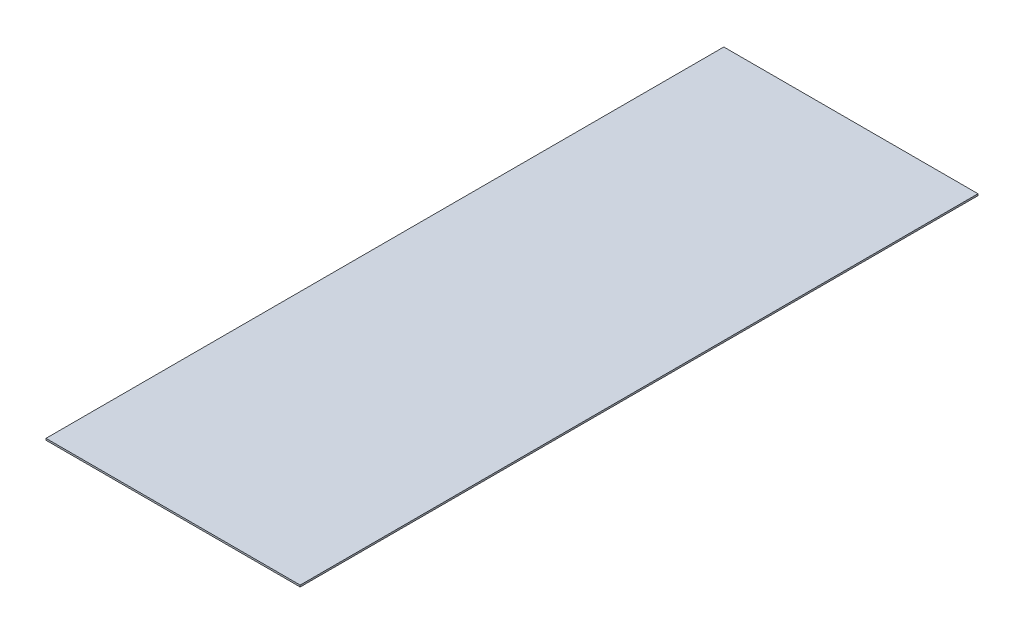
ISO-10303-21;
HEADER;
FILE_DESCRIPTION(('STEP AP214'),'2;1');
FILE_NAME('part.step','',(''),(''),'','','');
FILE_SCHEMA(('AUTOMOTIVE_DESIGN { 1 0 10303 214 1 1 1 1 }'));
ENDSEC;
DATA;
#1=APPLICATION_CONTEXT('core data for automotive mechanical design processes');
#2=APPLICATION_PROTOCOL_DEFINITION('international standard','automotive_design',2000,#1);
#3=PRODUCT_CONTEXT('',#1,'mechanical');
#4=PRODUCT('Part','Part','',(#3));
#5=PRODUCT_RELATED_PRODUCT_CATEGORY('part','',(#4));
#6=PRODUCT_DEFINITION_FORMATION('','',#4);
#7=PRODUCT_DEFINITION_CONTEXT('part definition',#1,'design');
#8=PRODUCT_DEFINITION('design','',#6,#7);
#9=PRODUCT_DEFINITION_SHAPE('','',#8);
#10=(LENGTH_UNIT() NAMED_UNIT(*) SI_UNIT(.MILLI.,.METRE.));
#11=(NAMED_UNIT(*) PLANE_ANGLE_UNIT() SI_UNIT($,.RADIAN.));
#12=(NAMED_UNIT(*) SI_UNIT($,.STERADIAN.) SOLID_ANGLE_UNIT());
#13=UNCERTAINTY_MEASURE_WITH_UNIT(LENGTH_MEASURE(1.E-05),#10,'distance_accuracy_value','');
#14=(GEOMETRIC_REPRESENTATION_CONTEXT(3) GLOBAL_UNCERTAINTY_ASSIGNED_CONTEXT((#13)) GLOBAL_UNIT_ASSIGNED_CONTEXT((#10,
#11,#12)) REPRESENTATION_CONTEXT('',''));
#15=CARTESIAN_POINT('',(0.,0.,0.));
#16=DIRECTION('',(0.,0.,1.));
#17=DIRECTION('',(1.,0.,0.));
#18=AXIS2_PLACEMENT_3D('',#15,#16,#17);
#19=CARTESIAN_POINT('',(0.75,0.01,-2.));
#20=DIRECTION('',(-1.,0.,0.));
#21=DIRECTION('',(0.,0.,1.));
#22=AXIS2_PLACEMENT_3D('',#19,#20,#21);
#23=PLANE('',#22);
#24=DIRECTION('',(0.,0.,-1.));
#25=VECTOR('',#24,1.);
#26=CARTESIAN_POINT('',(0.75,0.,-2.));
#27=LINE('',#26,#25);
#28=CARTESIAN_POINT('',(0.75,0.,2.));
#29=VERTEX_POINT('',#28);
#30=CARTESIAN_POINT('',(0.75,0.,-2.));
#31=VERTEX_POINT('',#30);
#32=EDGE_CURVE('E96',#29,#31,#27,.T.);
#33=ORIENTED_EDGE('',*,*,#32,.T.);
#34=DIRECTION('',(0.,-1.,0.));
#35=VECTOR('',#34,1.);
#36=CARTESIAN_POINT('',(0.75,0.01,-2.));
#37=LINE('',#36,#35);
#38=CARTESIAN_POINT('',(0.75,0.01,-2.));
#39=VERTEX_POINT('',#38);
#40=EDGE_CURVE('E11',#39,#31,#37,.T.);
#41=ORIENTED_EDGE('',*,*,#40,.F.);
#42=DIRECTION('',(0.,0.,-1.));
#43=VECTOR('',#42,1.);
#44=CARTESIAN_POINT('',(0.75,0.01,-2.));
#45=LINE('',#44,#43);
#46=CARTESIAN_POINT('',(0.75,0.01,2.));
#47=VERTEX_POINT('',#46);
#48=EDGE_CURVE('E84',#47,#39,#45,.T.);
#49=ORIENTED_EDGE('',*,*,#48,.F.);
#50=DIRECTION('',(0.,-1.,0.));
#51=VECTOR('',#50,1.);
#52=CARTESIAN_POINT('',(0.75,0.01,2.));
#53=LINE('',#52,#51);
#54=EDGE_CURVE('E92',#47,#29,#53,.T.);
#55=ORIENTED_EDGE('',*,*,#54,.T.);
#56=EDGE_LOOP('',(#33,#41,#49,#55));
#57=FACE_BOUND('',#56,.T.);
#58=ADVANCED_FACE('F33',(#57),#23,.F.);
#59=CARTESIAN_POINT('',(-0.75,0.01,-2.));
#60=DIRECTION('',(0.,0.,1.));
#61=DIRECTION('',(1.,0.,0.));
#62=AXIS2_PLACEMENT_3D('',#59,#60,#61);
#63=PLANE('',#62);
#64=DIRECTION('',(-1.,0.,0.));
#65=VECTOR('',#64,1.);
#66=CARTESIAN_POINT('',(-0.75,0.,-2.));
#67=LINE('',#66,#65);
#68=CARTESIAN_POINT('',(-0.75,0.,-2.));
#69=VERTEX_POINT('',#68);
#70=EDGE_CURVE('E88',#31,#69,#67,.T.);
#71=ORIENTED_EDGE('',*,*,#70,.T.);
#72=DIRECTION('',(0.,-1.,0.));
#73=VECTOR('',#72,1.);
#74=CARTESIAN_POINT('',(-0.75,0.01,-2.));
#75=LINE('',#74,#73);
#76=CARTESIAN_POINT('',(-0.75,0.01,-2.));
#77=VERTEX_POINT('',#76);
#78=EDGE_CURVE('E41',#77,#69,#75,.T.);
#79=ORIENTED_EDGE('',*,*,#78,.F.);
#80=DIRECTION('',(-1.,0.,0.));
#81=VECTOR('',#80,1.);
#82=CARTESIAN_POINT('',(-0.75,0.01,-2.));
#83=LINE('',#82,#81);
#84=EDGE_CURVE('E79',#39,#77,#83,.T.);
#85=ORIENTED_EDGE('',*,*,#84,.F.);
#86=ORIENTED_EDGE('',*,*,#40,.T.);
#87=EDGE_LOOP('',(#71,#79,#85,#86));
#88=FACE_BOUND('',#87,.T.);
#89=ADVANCED_FACE('F87',(#88),#63,.F.);
#90=CARTESIAN_POINT('',(-0.75,0.01,-2.));
#91=DIRECTION('',(1.,0.,0.));
#92=DIRECTION('',(0.,0.,-1.));
#93=AXIS2_PLACEMENT_3D('',#90,#91,#92);
#94=PLANE('',#93);
#95=DIRECTION('',(0.,0.,1.));
#96=VECTOR('',#95,1.);
#97=CARTESIAN_POINT('',(-0.75,0.,-2.));
#98=LINE('',#97,#96);
#99=CARTESIAN_POINT('',(-0.75,0.,2.));
#100=VERTEX_POINT('',#99);
#101=EDGE_CURVE('E66',#69,#100,#98,.T.);
#102=ORIENTED_EDGE('',*,*,#101,.T.);
#103=DIRECTION('',(0.,-1.,0.));
#104=VECTOR('',#103,1.);
#105=CARTESIAN_POINT('',(-0.75,0.01,2.));
#106=LINE('',#105,#104);
#107=CARTESIAN_POINT('',(-0.75,0.01,2.));
#108=VERTEX_POINT('',#107);
#109=EDGE_CURVE('E89',#108,#100,#106,.T.);
#110=ORIENTED_EDGE('',*,*,#109,.F.);
#111=DIRECTION('',(0.,0.,1.));
#112=VECTOR('',#111,1.);
#113=CARTESIAN_POINT('',(-0.75,0.01,-2.));
#114=LINE('',#113,#112);
#115=EDGE_CURVE('E82',#77,#108,#114,.T.);
#116=ORIENTED_EDGE('',*,*,#115,.F.);
#117=ORIENTED_EDGE('',*,*,#78,.T.);
#118=EDGE_LOOP('',(#102,#110,#116,#117));
#119=FACE_BOUND('',#118,.T.);
#120=ADVANCED_FACE('F90',(#119),#94,.F.);
#121=CARTESIAN_POINT('',(-0.75,0.01,2.));
#122=DIRECTION('',(0.,0.,-1.));
#123=DIRECTION('',(-1.,0.,0.));
#124=AXIS2_PLACEMENT_3D('',#121,#122,#123);
#125=PLANE('',#124);
#126=DIRECTION('',(1.,0.,0.));
#127=VECTOR('',#126,1.);
#128=CARTESIAN_POINT('',(-0.75,0.,2.));
#129=LINE('',#128,#127);
#130=EDGE_CURVE('E72',#100,#29,#129,.T.);
#131=ORIENTED_EDGE('',*,*,#130,.T.);
#132=ORIENTED_EDGE('',*,*,#54,.F.);
#133=DIRECTION('',(1.,0.,0.));
#134=VECTOR('',#133,1.);
#135=CARTESIAN_POINT('',(-0.75,0.01,2.));
#136=LINE('',#135,#134);
#137=EDGE_CURVE('E49',#108,#47,#136,.T.);
#138=ORIENTED_EDGE('',*,*,#137,.F.);
#139=ORIENTED_EDGE('',*,*,#109,.T.);
#140=EDGE_LOOP('',(#131,#132,#138,#139));
#141=FACE_BOUND('',#140,.T.);
#142=ADVANCED_FACE('F103',(#141),#125,.F.);
#143=CARTESIAN_POINT('',(0.,0.01,0.));
#144=DIRECTION('',(0.,1.,0.));
#145=DIRECTION('',(0.,0.,1.));
#146=AXIS2_PLACEMENT_3D('',#143,#144,#145);
#147=PLANE('',#146);
#148=ORIENTED_EDGE('',*,*,#48,.T.);
#149=ORIENTED_EDGE('',*,*,#84,.T.);
#150=ORIENTED_EDGE('',*,*,#115,.T.);
#151=ORIENTED_EDGE('',*,*,#137,.T.);
#152=EDGE_LOOP('',(#148,#149,#150,#151));
#153=FACE_BOUND('',#152,.T.);
#154=ADVANCED_FACE('F80',(#153),#147,.T.);
#155=CARTESIAN_POINT('',(0.,0.,0.));
#156=DIRECTION('',(0.,1.,0.));
#157=DIRECTION('',(0.,0.,1.));
#158=AXIS2_PLACEMENT_3D('',#155,#156,#157);
#159=PLANE('',#158);
#160=ORIENTED_EDGE('',*,*,#32,.F.);
#161=ORIENTED_EDGE('',*,*,#130,.F.);
#162=ORIENTED_EDGE('',*,*,#101,.F.);
#163=ORIENTED_EDGE('',*,*,#70,.F.);
#164=EDGE_LOOP('',(#160,#161,#162,#163));
#165=FACE_BOUND('',#164,.T.);
#166=ADVANCED_FACE('F106',(#165),#159,.F.);
#167=CLOSED_SHELL('',(#58,#89,#120,#142,#154,#166));
#168=MANIFOLD_SOLID_BREP('B2',#167);
#169=ADVANCED_BREP_SHAPE_REPRESENTATION('',(#18,#168),#14);
#170=SHAPE_DEFINITION_REPRESENTATION(#9,#169);
ENDSEC;
END-ISO-10303-21;
